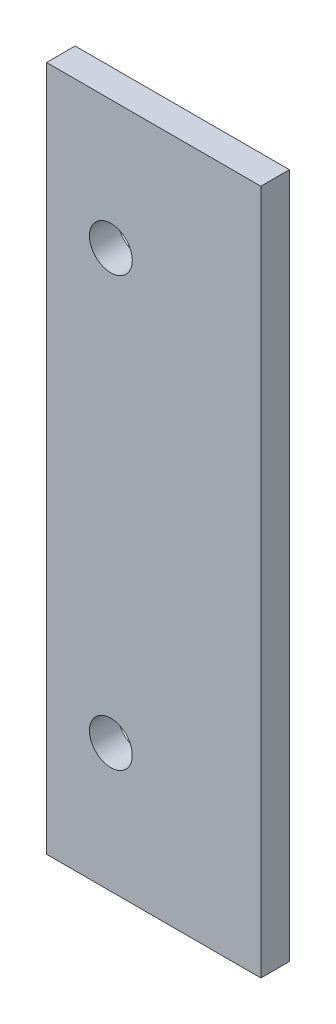
ISO-10303-21;
HEADER;
FILE_DESCRIPTION(('STEP AP214'),'2;1');
FILE_NAME('part.step','',(''),(''),'','','');
FILE_SCHEMA(('AUTOMOTIVE_DESIGN { 1 0 10303 214 1 1 1 1 }'));
ENDSEC;
DATA;
#1=APPLICATION_CONTEXT('core data for automotive mechanical design processes');
#2=APPLICATION_PROTOCOL_DEFINITION('international standard','automotive_design',2000,#1);
#3=PRODUCT_CONTEXT('',#1,'mechanical');
#4=PRODUCT('Part','Part','',(#3));
#5=PRODUCT_RELATED_PRODUCT_CATEGORY('part','',(#4));
#6=PRODUCT_DEFINITION_FORMATION('','',#4);
#7=PRODUCT_DEFINITION_CONTEXT('part definition',#1,'design');
#8=PRODUCT_DEFINITION('design','',#6,#7);
#9=PRODUCT_DEFINITION_SHAPE('','',#8);
#10=(LENGTH_UNIT() NAMED_UNIT(*) SI_UNIT(.MILLI.,.METRE.));
#11=(NAMED_UNIT(*) PLANE_ANGLE_UNIT() SI_UNIT($,.RADIAN.));
#12=(NAMED_UNIT(*) SI_UNIT($,.STERADIAN.) SOLID_ANGLE_UNIT());
#13=UNCERTAINTY_MEASURE_WITH_UNIT(LENGTH_MEASURE(1.E-05),#10,'distance_accuracy_value','');
#14=(GEOMETRIC_REPRESENTATION_CONTEXT(3) GLOBAL_UNCERTAINTY_ASSIGNED_CONTEXT((#13)) GLOBAL_UNIT_ASSIGNED_CONTEXT((#10,
#11,#12)) REPRESENTATION_CONTEXT('',''));
#15=CARTESIAN_POINT('',(0.,0.,0.));
#16=DIRECTION('',(0.,0.,1.));
#17=DIRECTION('',(1.,0.,0.));
#18=AXIS2_PLACEMENT_3D('',#15,#16,#17);
#19=CARTESIAN_POINT('',(0.,0.,2.));
#20=DIRECTION('',(0.,0.,-1.));
#21=DIRECTION('',(-1.,0.,0.));
#22=AXIS2_PLACEMENT_3D('',#19,#20,#21);
#23=PLANE('',#22);
#24=CARTESIAN_POINT('',(4.5,-9.,2.));
#25=DIRECTION('',(0.,0.,1.));
#26=DIRECTION('',(1.,0.,0.));
#27=AXIS2_PLACEMENT_3D('',#24,#25,#26);
#28=CIRCLE('',#27,1.5);
#29=CARTESIAN_POINT('',(6.,-9.,2.));
#30=VERTEX_POINT('',#29);
#31=EDGE_CURVE('E97',#30,#30,#28,.T.);
#32=ORIENTED_EDGE('',*,*,#31,.F.);
#33=EDGE_LOOP('',(#32));
#34=FACE_BOUND('',#33,.T.);
#35=DIRECTION('',(0.,-1.,0.));
#36=VECTOR('',#35,1.);
#37=CARTESIAN_POINT('',(0.,-48.,2.));
#38=LINE('',#37,#36);
#39=CARTESIAN_POINT('',(0.,0.,2.));
#40=VERTEX_POINT('',#39);
#41=CARTESIAN_POINT('',(0.,-48.,2.));
#42=VERTEX_POINT('',#41);
#43=EDGE_CURVE('E82',#40,#42,#38,.T.);
#44=ORIENTED_EDGE('',*,*,#43,.T.);
#45=DIRECTION('',(1.,0.,0.));
#46=VECTOR('',#45,1.);
#47=CARTESIAN_POINT('',(15.,-48.,2.));
#48=LINE('',#47,#46);
#49=CARTESIAN_POINT('',(15.,-48.,2.));
#50=VERTEX_POINT('',#49);
#51=EDGE_CURVE('E77',#42,#50,#48,.T.);
#52=ORIENTED_EDGE('',*,*,#51,.T.);
#53=DIRECTION('',(0.,1.,0.));
#54=VECTOR('',#53,1.);
#55=CARTESIAN_POINT('',(15.,0.,2.));
#56=LINE('',#55,#54);
#57=CARTESIAN_POINT('',(15.,0.,2.));
#58=VERTEX_POINT('',#57);
#59=EDGE_CURVE('E80',#50,#58,#56,.T.);
#60=ORIENTED_EDGE('',*,*,#59,.T.);
#61=DIRECTION('',(-1.,0.,0.));
#62=VECTOR('',#61,1.);
#63=CARTESIAN_POINT('',(0.,0.,2.));
#64=LINE('',#63,#62);
#65=EDGE_CURVE('E47',#58,#40,#64,.T.);
#66=ORIENTED_EDGE('',*,*,#65,.T.);
#67=EDGE_LOOP('',(#44,#52,#60,#66));
#68=FACE_BOUND('',#67,.T.);
#69=CARTESIAN_POINT('',(4.49999999999986,-39.,2.));
#70=DIRECTION('',(0.,0.,1.));
#71=DIRECTION('',(-1.,0.,0.));
#72=AXIS2_PLACEMENT_3D('',#69,#70,#71);
#73=CIRCLE('',#72,1.5);
#74=CARTESIAN_POINT('',(2.99999999999986,-39.,2.));
#75=VERTEX_POINT('',#74);
#76=EDGE_CURVE('E112',#75,#75,#73,.T.);
#77=ORIENTED_EDGE('',*,*,#76,.F.);
#78=EDGE_LOOP('',(#77));
#79=FACE_BOUND('',#78,.T.);
#80=ADVANCED_FACE('F30',(#34,#68,#79),#23,.F.);
#81=CARTESIAN_POINT('',(0.,0.,0.));
#82=DIRECTION('',(0.,0.,-1.));
#83=DIRECTION('',(-1.,0.,0.));
#84=AXIS2_PLACEMENT_3D('',#81,#82,#83);
#85=PLANE('',#84);
#86=CARTESIAN_POINT('',(4.5,-9.,0.));
#87=DIRECTION('',(0.,0.,1.));
#88=DIRECTION('',(1.,0.,0.));
#89=AXIS2_PLACEMENT_3D('',#86,#87,#88);
#90=CIRCLE('',#89,1.5);
#91=CARTESIAN_POINT('',(6.,-9.,0.));
#92=VERTEX_POINT('',#91);
#93=EDGE_CURVE('E109',#92,#92,#90,.T.);
#94=ORIENTED_EDGE('',*,*,#93,.T.);
#95=EDGE_LOOP('',(#94));
#96=FACE_BOUND('',#95,.T.);
#97=DIRECTION('',(0.,-1.,0.));
#98=VECTOR('',#97,1.);
#99=CARTESIAN_POINT('',(0.,-48.,0.));
#100=LINE('',#99,#98);
#101=CARTESIAN_POINT('',(0.,0.,0.));
#102=VERTEX_POINT('',#101);
#103=CARTESIAN_POINT('',(0.,-48.,0.));
#104=VERTEX_POINT('',#103);
#105=EDGE_CURVE('E94',#102,#104,#100,.T.);
#106=ORIENTED_EDGE('',*,*,#105,.F.);
#107=DIRECTION('',(-1.,0.,0.));
#108=VECTOR('',#107,1.);
#109=CARTESIAN_POINT('',(0.,0.,0.));
#110=LINE('',#109,#108);
#111=CARTESIAN_POINT('',(15.,0.,0.));
#112=VERTEX_POINT('',#111);
#113=EDGE_CURVE('E70',#112,#102,#110,.T.);
#114=ORIENTED_EDGE('',*,*,#113,.F.);
#115=DIRECTION('',(0.,1.,0.));
#116=VECTOR('',#115,1.);
#117=CARTESIAN_POINT('',(15.,0.,0.));
#118=LINE('',#117,#116);
#119=CARTESIAN_POINT('',(15.,-48.,0.));
#120=VERTEX_POINT('',#119);
#121=EDGE_CURVE('E64',#120,#112,#118,.T.);
#122=ORIENTED_EDGE('',*,*,#121,.F.);
#123=DIRECTION('',(1.,0.,0.));
#124=VECTOR('',#123,1.);
#125=CARTESIAN_POINT('',(15.,-48.,0.));
#126=LINE('',#125,#124);
#127=EDGE_CURVE('E86',#104,#120,#126,.T.);
#128=ORIENTED_EDGE('',*,*,#127,.F.);
#129=EDGE_LOOP('',(#106,#114,#122,#128));
#130=FACE_BOUND('',#129,.T.);
#131=CARTESIAN_POINT('',(4.49999999999986,-39.,0.));
#132=DIRECTION('',(0.,0.,1.));
#133=DIRECTION('',(-1.,0.,0.));
#134=AXIS2_PLACEMENT_3D('',#131,#132,#133);
#135=CIRCLE('',#134,1.5);
#136=CARTESIAN_POINT('',(2.99999999999986,-39.,0.));
#137=VERTEX_POINT('',#136);
#138=EDGE_CURVE('E115',#137,#137,#135,.T.);
#139=ORIENTED_EDGE('',*,*,#138,.T.);
#140=EDGE_LOOP('',(#139));
#141=FACE_BOUND('',#140,.T.);
#142=ADVANCED_FACE('F105',(#96,#130,#141),#85,.T.);
#143=CARTESIAN_POINT('',(0.,-48.,2.));
#144=DIRECTION('',(1.,0.,0.));
#145=DIRECTION('',(0.,0.,-1.));
#146=AXIS2_PLACEMENT_3D('',#143,#144,#145);
#147=PLANE('',#146);
#148=ORIENTED_EDGE('',*,*,#105,.T.);
#149=DIRECTION('',(0.,0.,-1.));
#150=VECTOR('',#149,1.);
#151=CARTESIAN_POINT('',(0.,-48.,2.));
#152=LINE('',#151,#150);
#153=EDGE_CURVE('E11',#42,#104,#152,.T.);
#154=ORIENTED_EDGE('',*,*,#153,.F.);
#155=ORIENTED_EDGE('',*,*,#43,.F.);
#156=DIRECTION('',(0.,0.,-1.));
#157=VECTOR('',#156,1.);
#158=CARTESIAN_POINT('',(0.,0.,2.));
#159=LINE('',#158,#157);
#160=EDGE_CURVE('E90',#40,#102,#159,.T.);
#161=ORIENTED_EDGE('',*,*,#160,.T.);
#162=EDGE_LOOP('',(#148,#154,#155,#161));
#163=FACE_BOUND('',#162,.T.);
#164=ADVANCED_FACE('F32',(#163),#147,.F.);
#165=CARTESIAN_POINT('',(15.,-48.,2.));
#166=DIRECTION('',(0.,1.,0.));
#167=DIRECTION('',(0.,0.,1.));
#168=AXIS2_PLACEMENT_3D('',#165,#166,#167);
#169=PLANE('',#168);
#170=ORIENTED_EDGE('',*,*,#127,.T.);
#171=DIRECTION('',(0.,0.,-1.));
#172=VECTOR('',#171,1.);
#173=CARTESIAN_POINT('',(15.,-48.,2.));
#174=LINE('',#173,#172);
#175=EDGE_CURVE('E39',#50,#120,#174,.T.);
#176=ORIENTED_EDGE('',*,*,#175,.F.);
#177=ORIENTED_EDGE('',*,*,#51,.F.);
#178=ORIENTED_EDGE('',*,*,#153,.T.);
#179=EDGE_LOOP('',(#170,#176,#177,#178));
#180=FACE_BOUND('',#179,.T.);
#181=ADVANCED_FACE('F85',(#180),#169,.F.);
#182=CARTESIAN_POINT('',(15.,0.,2.));
#183=DIRECTION('',(-1.,0.,0.));
#184=DIRECTION('',(0.,-1.,0.));
#185=AXIS2_PLACEMENT_3D('',#182,#183,#184);
#186=PLANE('',#185);
#187=ORIENTED_EDGE('',*,*,#121,.T.);
#188=DIRECTION('',(0.,0.,-1.));
#189=VECTOR('',#188,1.);
#190=CARTESIAN_POINT('',(15.,0.,2.));
#191=LINE('',#190,#189);
#192=EDGE_CURVE('E87',#58,#112,#191,.T.);
#193=ORIENTED_EDGE('',*,*,#192,.F.);
#194=ORIENTED_EDGE('',*,*,#59,.F.);
#195=ORIENTED_EDGE('',*,*,#175,.T.);
#196=EDGE_LOOP('',(#187,#193,#194,#195));
#197=FACE_BOUND('',#196,.T.);
#198=ADVANCED_FACE('F88',(#197),#186,.F.);
#199=CARTESIAN_POINT('',(0.,0.,2.));
#200=DIRECTION('',(0.,-1.,0.));
#201=DIRECTION('',(0.,0.,-1.));
#202=AXIS2_PLACEMENT_3D('',#199,#200,#201);
#203=PLANE('',#202);
#204=ORIENTED_EDGE('',*,*,#113,.T.);
#205=ORIENTED_EDGE('',*,*,#160,.F.);
#206=ORIENTED_EDGE('',*,*,#65,.F.);
#207=ORIENTED_EDGE('',*,*,#192,.T.);
#208=EDGE_LOOP('',(#204,#205,#206,#207));
#209=FACE_BOUND('',#208,.T.);
#210=ADVANCED_FACE('F102',(#209),#203,.F.);
#211=CARTESIAN_POINT('',(4.5,-9.,2.));
#212=DIRECTION('',(0.,0.,-1.));
#213=DIRECTION('',(-1.,0.,0.));
#214=AXIS2_PLACEMENT_3D('',#211,#212,#213);
#215=CYLINDRICAL_SURFACE('',#214,1.5);
#216=ORIENTED_EDGE('',*,*,#31,.T.);
#217=EDGE_LOOP('',(#216));
#218=FACE_BOUND('',#217,.T.);
#219=ORIENTED_EDGE('',*,*,#93,.F.);
#220=EDGE_LOOP('',(#219));
#221=FACE_BOUND('',#220,.T.);
#222=ADVANCED_FACE('F133',(#218,#221),#215,.F.);
#223=CARTESIAN_POINT('',(4.49999999999986,-39.,2.));
#224=DIRECTION('',(0.,0.,-1.));
#225=DIRECTION('',(-1.,0.,0.));
#226=AXIS2_PLACEMENT_3D('',#223,#224,#225);
#227=CYLINDRICAL_SURFACE('',#226,1.5);
#228=ORIENTED_EDGE('',*,*,#76,.T.);
#229=EDGE_LOOP('',(#228));
#230=FACE_BOUND('',#229,.T.);
#231=ORIENTED_EDGE('',*,*,#138,.F.);
#232=EDGE_LOOP('',(#231));
#233=FACE_BOUND('',#232,.T.);
#234=ADVANCED_FACE('F121',(#230,#233),#227,.F.);
#235=CLOSED_SHELL('',(#80,#142,#164,#181,#198,#210,#222,#234));
#236=MANIFOLD_SOLID_BREP('B2',#235);
#237=ADVANCED_BREP_SHAPE_REPRESENTATION('',(#18,#236),#14);
#238=SHAPE_DEFINITION_REPRESENTATION(#9,#237);
ENDSEC;
END-ISO-10303-21;
